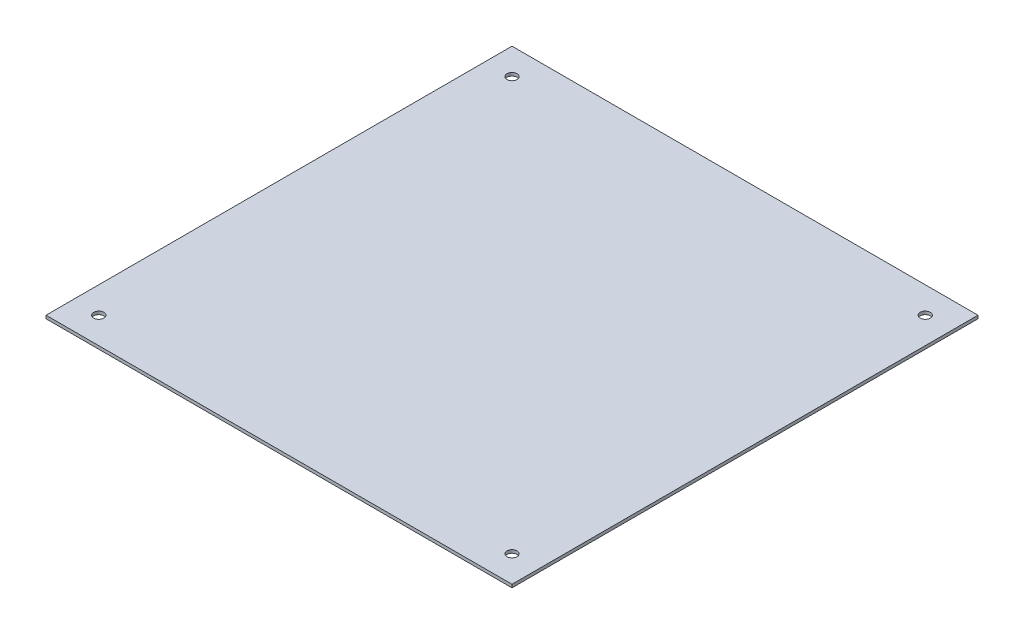
ISO-10303-21;
HEADER;
FILE_DESCRIPTION(('STEP AP214'),'2;1');
FILE_NAME('part.step','',(''),(''),'','','');
FILE_SCHEMA(('AUTOMOTIVE_DESIGN { 1 0 10303 214 1 1 1 1 }'));
ENDSEC;
DATA;
#1=APPLICATION_CONTEXT('core data for automotive mechanical design processes');
#2=APPLICATION_PROTOCOL_DEFINITION('international standard','automotive_design',2000,#1);
#3=PRODUCT_CONTEXT('',#1,'mechanical');
#4=PRODUCT('Part','Part','',(#3));
#5=PRODUCT_RELATED_PRODUCT_CATEGORY('part','',(#4));
#6=PRODUCT_DEFINITION_FORMATION('','',#4);
#7=PRODUCT_DEFINITION_CONTEXT('part definition',#1,'design');
#8=PRODUCT_DEFINITION('design','',#6,#7);
#9=PRODUCT_DEFINITION_SHAPE('','',#8);
#10=(LENGTH_UNIT() NAMED_UNIT(*) SI_UNIT(.MILLI.,.METRE.));
#11=(NAMED_UNIT(*) PLANE_ANGLE_UNIT() SI_UNIT($,.RADIAN.));
#12=(NAMED_UNIT(*) SI_UNIT($,.STERADIAN.) SOLID_ANGLE_UNIT());
#13=UNCERTAINTY_MEASURE_WITH_UNIT(LENGTH_MEASURE(1.E-05),#10,'distance_accuracy_value','');
#14=(GEOMETRIC_REPRESENTATION_CONTEXT(3) GLOBAL_UNCERTAINTY_ASSIGNED_CONTEXT((#13)) GLOBAL_UNIT_ASSIGNED_CONTEXT((#10,
#11,#12)) REPRESENTATION_CONTEXT('',''));
#15=CARTESIAN_POINT('',(0.,0.,0.));
#16=DIRECTION('',(0.,0.,1.));
#17=DIRECTION('',(1.,0.,0.));
#18=AXIS2_PLACEMENT_3D('',#15,#16,#17);
#19=CARTESIAN_POINT('',(150.,-2.,150.));
#20=DIRECTION('',(1.,0.,0.));
#21=DIRECTION('',(0.,0.,-1.));
#22=AXIS2_PLACEMENT_3D('',#19,#20,#21);
#23=PLANE('',#22);
#24=DIRECTION('',(0.,0.,-1.));
#25=VECTOR('',#24,1.);
#26=CARTESIAN_POINT('',(150.,0.,150.));
#27=LINE('',#26,#25);
#28=CARTESIAN_POINT('',(150.,0.,150.));
#29=VERTEX_POINT('',#28);
#30=CARTESIAN_POINT('',(150.,0.,-150.));
#31=VERTEX_POINT('',#30);
#32=EDGE_CURVE('E103',#29,#31,#27,.T.);
#33=ORIENTED_EDGE('',*,*,#32,.F.);
#34=DIRECTION('',(0.,1.,0.));
#35=VECTOR('',#34,1.);
#36=CARTESIAN_POINT('',(150.,-2.,150.));
#37=LINE('',#36,#35);
#38=CARTESIAN_POINT('',(150.,-2.,150.));
#39=VERTEX_POINT('',#38);
#40=EDGE_CURVE('E11',#39,#29,#37,.T.);
#41=ORIENTED_EDGE('',*,*,#40,.F.);
#42=DIRECTION('',(0.,0.,-1.));
#43=VECTOR('',#42,1.);
#44=CARTESIAN_POINT('',(150.,-2.,150.));
#45=LINE('',#44,#43);
#46=CARTESIAN_POINT('',(150.,-2.,-150.));
#47=VERTEX_POINT('',#46);
#48=EDGE_CURVE('E96',#39,#47,#45,.T.);
#49=ORIENTED_EDGE('',*,*,#48,.T.);
#50=DIRECTION('',(0.,1.,0.));
#51=VECTOR('',#50,1.);
#52=CARTESIAN_POINT('',(150.,-2.,-150.));
#53=LINE('',#52,#51);
#54=EDGE_CURVE('E41',#47,#31,#53,.T.);
#55=ORIENTED_EDGE('',*,*,#54,.T.);
#56=EDGE_LOOP('',(#33,#41,#49,#55));
#57=FACE_BOUND('',#56,.T.);
#58=ADVANCED_FACE('F38',(#57),#23,.T.);
#59=CARTESIAN_POINT('',(-150.,-2.,150.));
#60=DIRECTION('',(0.,0.,1.));
#61=DIRECTION('',(1.,0.,0.));
#62=AXIS2_PLACEMENT_3D('',#59,#60,#61);
#63=PLANE('',#62);
#64=DIRECTION('',(1.,0.,0.));
#65=VECTOR('',#64,1.);
#66=CARTESIAN_POINT('',(-150.,0.,150.));
#67=LINE('',#66,#65);
#68=CARTESIAN_POINT('',(-150.,0.,150.));
#69=VERTEX_POINT('',#68);
#70=EDGE_CURVE('E98',#69,#29,#67,.T.);
#71=ORIENTED_EDGE('',*,*,#70,.F.);
#72=DIRECTION('',(0.,1.,0.));
#73=VECTOR('',#72,1.);
#74=CARTESIAN_POINT('',(-150.,-2.,150.));
#75=LINE('',#74,#73);
#76=CARTESIAN_POINT('',(-150.,-2.,150.));
#77=VERTEX_POINT('',#76);
#78=EDGE_CURVE('E47',#77,#69,#75,.T.);
#79=ORIENTED_EDGE('',*,*,#78,.F.);
#80=DIRECTION('',(1.,0.,0.));
#81=VECTOR('',#80,1.);
#82=CARTESIAN_POINT('',(-150.,-2.,150.));
#83=LINE('',#82,#81);
#84=EDGE_CURVE('E93',#77,#39,#83,.T.);
#85=ORIENTED_EDGE('',*,*,#84,.T.);
#86=ORIENTED_EDGE('',*,*,#40,.T.);
#87=EDGE_LOOP('',(#71,#79,#85,#86));
#88=FACE_BOUND('',#87,.T.);
#89=ADVANCED_FACE('F114',(#88),#63,.T.);
#90=CARTESIAN_POINT('',(-150.,-2.,150.));
#91=DIRECTION('',(-1.,0.,0.));
#92=DIRECTION('',(0.,0.,1.));
#93=AXIS2_PLACEMENT_3D('',#90,#91,#92);
#94=PLANE('',#93);
#95=DIRECTION('',(0.,0.,1.));
#96=VECTOR('',#95,1.);
#97=CARTESIAN_POINT('',(-150.,0.,150.));
#98=LINE('',#97,#96);
#99=CARTESIAN_POINT('',(-150.,0.,-150.));
#100=VERTEX_POINT('',#99);
#101=EDGE_CURVE('E88',#100,#69,#98,.T.);
#102=ORIENTED_EDGE('',*,*,#101,.F.);
#103=DIRECTION('',(0.,1.,0.));
#104=VECTOR('',#103,1.);
#105=CARTESIAN_POINT('',(-150.,-2.,-150.));
#106=LINE('',#105,#104);
#107=CARTESIAN_POINT('',(-150.,-2.,-150.));
#108=VERTEX_POINT('',#107);
#109=EDGE_CURVE('E83',#108,#100,#106,.T.);
#110=ORIENTED_EDGE('',*,*,#109,.F.);
#111=DIRECTION('',(0.,0.,1.));
#112=VECTOR('',#111,1.);
#113=CARTESIAN_POINT('',(-150.,-2.,150.));
#114=LINE('',#113,#112);
#115=EDGE_CURVE('E86',#108,#77,#114,.T.);
#116=ORIENTED_EDGE('',*,*,#115,.T.);
#117=ORIENTED_EDGE('',*,*,#78,.T.);
#118=EDGE_LOOP('',(#102,#110,#116,#117));
#119=FACE_BOUND('',#118,.T.);
#120=ADVANCED_FACE('F85',(#119),#94,.T.);
#121=CARTESIAN_POINT('',(-150.,-2.,-150.));
#122=DIRECTION('',(0.,0.,-1.));
#123=DIRECTION('',(-1.,0.,0.));
#124=AXIS2_PLACEMENT_3D('',#121,#122,#123);
#125=PLANE('',#124);
#126=DIRECTION('',(-1.,0.,0.));
#127=VECTOR('',#126,1.);
#128=CARTESIAN_POINT('',(-150.,0.,-150.));
#129=LINE('',#128,#127);
#130=EDGE_CURVE('E106',#31,#100,#129,.T.);
#131=ORIENTED_EDGE('',*,*,#130,.F.);
#132=ORIENTED_EDGE('',*,*,#54,.F.);
#133=DIRECTION('',(-1.,0.,0.));
#134=VECTOR('',#133,1.);
#135=CARTESIAN_POINT('',(-150.,-2.,-150.));
#136=LINE('',#135,#134);
#137=EDGE_CURVE('E92',#47,#108,#136,.T.);
#138=ORIENTED_EDGE('',*,*,#137,.T.);
#139=ORIENTED_EDGE('',*,*,#109,.T.);
#140=EDGE_LOOP('',(#131,#132,#138,#139));
#141=FACE_BOUND('',#140,.T.);
#142=ADVANCED_FACE('F95',(#141),#125,.T.);
#143=CARTESIAN_POINT('',(0.,-2.,0.));
#144=DIRECTION('',(0.,-1.,0.));
#145=DIRECTION('',(0.,0.,-1.));
#146=AXIS2_PLACEMENT_3D('',#143,#144,#145);
#147=PLANE('',#146);
#148=CARTESIAN_POINT('',(-133.,-2.,-133.));
#149=DIRECTION('',(0.,-1.,0.));
#150=DIRECTION('',(0.,0.,-1.));
#151=AXIS2_PLACEMENT_3D('',#148,#149,#150);
#152=CIRCLE('',#151,3.24999999999999);
#153=CARTESIAN_POINT('',(-133.,-2.,-136.25));
#154=VERTEX_POINT('',#153);
#155=EDGE_CURVE('E158',#154,#154,#152,.T.);
#156=ORIENTED_EDGE('',*,*,#155,.F.);
#157=EDGE_LOOP('',(#156));
#158=FACE_BOUND('',#157,.T.);
#159=CARTESIAN_POINT('',(132.999999999997,-2.,-133.));
#160=DIRECTION('',(0.,-1.,0.));
#161=DIRECTION('',(0.,0.,-1.));
#162=AXIS2_PLACEMENT_3D('',#159,#160,#161);
#163=CIRCLE('',#162,3.24999999999999);
#164=CARTESIAN_POINT('',(132.999999999997,-2.,-136.25));
#165=VERTEX_POINT('',#164);
#166=EDGE_CURVE('E162',#165,#165,#163,.T.);
#167=ORIENTED_EDGE('',*,*,#166,.F.);
#168=EDGE_LOOP('',(#167));
#169=FACE_BOUND('',#168,.T.);
#170=CARTESIAN_POINT('',(133.,-2.,133.));
#171=DIRECTION('',(0.,-1.,0.));
#172=DIRECTION('',(0.,0.,-1.));
#173=AXIS2_PLACEMENT_3D('',#170,#171,#172);
#174=CIRCLE('',#173,3.24999999999999);
#175=CARTESIAN_POINT('',(133.,-2.,129.75));
#176=VERTEX_POINT('',#175);
#177=EDGE_CURVE('E171',#176,#176,#174,.T.);
#178=ORIENTED_EDGE('',*,*,#177,.F.);
#179=EDGE_LOOP('',(#178));
#180=FACE_BOUND('',#179,.T.);
#181=CARTESIAN_POINT('',(-132.999999999997,-2.,133.));
#182=DIRECTION('',(0.,-1.,0.));
#183=DIRECTION('',(0.,0.,-1.));
#184=AXIS2_PLACEMENT_3D('',#181,#182,#183);
#185=CIRCLE('',#184,3.24999999999999);
#186=CARTESIAN_POINT('',(-132.999999999997,-2.,129.75));
#187=VERTEX_POINT('',#186);
#188=EDGE_CURVE('E107',#187,#187,#185,.T.);
#189=ORIENTED_EDGE('',*,*,#188,.F.);
#190=EDGE_LOOP('',(#189));
#191=FACE_BOUND('',#190,.T.);
#192=ORIENTED_EDGE('',*,*,#48,.F.);
#193=ORIENTED_EDGE('',*,*,#84,.F.);
#194=ORIENTED_EDGE('',*,*,#115,.F.);
#195=ORIENTED_EDGE('',*,*,#137,.F.);
#196=EDGE_LOOP('',(#192,#193,#194,#195));
#197=FACE_BOUND('',#196,.T.);
#198=ADVANCED_FACE('F91',(#158,#169,#180,#191,#197),#147,.T.);
#199=CARTESIAN_POINT('',(0.,0.,0.));
#200=DIRECTION('',(0.,-1.,0.));
#201=DIRECTION('',(0.,0.,-1.));
#202=AXIS2_PLACEMENT_3D('',#199,#200,#201);
#203=PLANE('',#202);
#204=CARTESIAN_POINT('',(-133.,0.,-133.));
#205=DIRECTION('',(0.,1.,0.));
#206=DIRECTION('',(0.,0.,1.));
#207=AXIS2_PLACEMENT_3D('',#204,#205,#206);
#208=CIRCLE('',#207,3.24999999999998);
#209=CARTESIAN_POINT('',(-133.,0.,-129.75));
#210=VERTEX_POINT('',#209);
#211=EDGE_CURVE('E156',#210,#210,#208,.T.);
#212=ORIENTED_EDGE('',*,*,#211,.F.);
#213=EDGE_LOOP('',(#212));
#214=FACE_BOUND('',#213,.T.);
#215=CARTESIAN_POINT('',(132.999999999997,0.,-133.));
#216=DIRECTION('',(0.,1.,0.));
#217=DIRECTION('',(0.,0.,1.));
#218=AXIS2_PLACEMENT_3D('',#215,#216,#217);
#219=CIRCLE('',#218,3.24999999999998);
#220=CARTESIAN_POINT('',(132.999999999997,0.,-129.75));
#221=VERTEX_POINT('',#220);
#222=EDGE_CURVE('E159',#221,#221,#219,.T.);
#223=ORIENTED_EDGE('',*,*,#222,.F.);
#224=EDGE_LOOP('',(#223));
#225=FACE_BOUND('',#224,.T.);
#226=CARTESIAN_POINT('',(133.,0.,133.));
#227=DIRECTION('',(0.,1.,0.));
#228=DIRECTION('',(0.,0.,1.));
#229=AXIS2_PLACEMENT_3D('',#226,#227,#228);
#230=CIRCLE('',#229,3.24999999999998);
#231=CARTESIAN_POINT('',(133.,0.,136.25));
#232=VERTEX_POINT('',#231);
#233=EDGE_CURVE('E168',#232,#232,#230,.T.);
#234=ORIENTED_EDGE('',*,*,#233,.F.);
#235=EDGE_LOOP('',(#234));
#236=FACE_BOUND('',#235,.T.);
#237=CARTESIAN_POINT('',(-132.999999999997,0.,133.));
#238=DIRECTION('',(0.,1.,0.));
#239=DIRECTION('',(0.,0.,1.));
#240=AXIS2_PLACEMENT_3D('',#237,#238,#239);
#241=CIRCLE('',#240,3.24999999999998);
#242=CARTESIAN_POINT('',(-132.999999999997,0.,136.25));
#243=VERTEX_POINT('',#242);
#244=EDGE_CURVE('E174',#243,#243,#241,.T.);
#245=ORIENTED_EDGE('',*,*,#244,.F.);
#246=EDGE_LOOP('',(#245));
#247=FACE_BOUND('',#246,.T.);
#248=ORIENTED_EDGE('',*,*,#32,.T.);
#249=ORIENTED_EDGE('',*,*,#130,.T.);
#250=ORIENTED_EDGE('',*,*,#101,.T.);
#251=ORIENTED_EDGE('',*,*,#70,.T.);
#252=EDGE_LOOP('',(#248,#249,#250,#251));
#253=FACE_BOUND('',#252,.T.);
#254=ADVANCED_FACE('F113',(#214,#225,#236,#247,#253),#203,.F.);
#255=CARTESIAN_POINT('',(-132.999999999997,0.,133.));
#256=DIRECTION('',(0.,1.,0.));
#257=DIRECTION('',(0.,0.,1.));
#258=AXIS2_PLACEMENT_3D('',#255,#256,#257);
#259=CYLINDRICAL_SURFACE('',#258,3.24999999999999);
#260=ORIENTED_EDGE('',*,*,#244,.T.);
#261=EDGE_LOOP('',(#260));
#262=FACE_BOUND('',#261,.T.);
#263=ORIENTED_EDGE('',*,*,#188,.T.);
#264=EDGE_LOOP('',(#263));
#265=FACE_BOUND('',#264,.T.);
#266=ADVANCED_FACE('F132',(#262,#265),#259,.F.);
#267=CARTESIAN_POINT('',(133.,0.,133.));
#268=DIRECTION('',(0.,1.,0.));
#269=DIRECTION('',(0.,0.,1.));
#270=AXIS2_PLACEMENT_3D('',#267,#268,#269);
#271=CYLINDRICAL_SURFACE('',#270,3.24999999999999);
#272=ORIENTED_EDGE('',*,*,#233,.T.);
#273=EDGE_LOOP('',(#272));
#274=FACE_BOUND('',#273,.T.);
#275=ORIENTED_EDGE('',*,*,#177,.T.);
#276=EDGE_LOOP('',(#275));
#277=FACE_BOUND('',#276,.T.);
#278=ADVANCED_FACE('F139',(#274,#277),#271,.F.);
#279=CARTESIAN_POINT('',(132.999999999997,0.,-133.));
#280=DIRECTION('',(0.,1.,0.));
#281=DIRECTION('',(0.,0.,1.));
#282=AXIS2_PLACEMENT_3D('',#279,#280,#281);
#283=CYLINDRICAL_SURFACE('',#282,3.24999999999999);
#284=ORIENTED_EDGE('',*,*,#222,.T.);
#285=EDGE_LOOP('',(#284));
#286=FACE_BOUND('',#285,.T.);
#287=ORIENTED_EDGE('',*,*,#166,.T.);
#288=EDGE_LOOP('',(#287));
#289=FACE_BOUND('',#288,.T.);
#290=ADVANCED_FACE('F143',(#286,#289),#283,.F.);
#291=CARTESIAN_POINT('',(-133.,0.,-133.));
#292=DIRECTION('',(0.,1.,0.));
#293=DIRECTION('',(0.,0.,1.));
#294=AXIS2_PLACEMENT_3D('',#291,#292,#293);
#295=CYLINDRICAL_SURFACE('',#294,3.24999999999999);
#296=ORIENTED_EDGE('',*,*,#211,.T.);
#297=EDGE_LOOP('',(#296));
#298=FACE_BOUND('',#297,.T.);
#299=ORIENTED_EDGE('',*,*,#155,.T.);
#300=EDGE_LOOP('',(#299));
#301=FACE_BOUND('',#300,.T.);
#302=ADVANCED_FACE('F147',(#298,#301),#295,.F.);
#303=CLOSED_SHELL('',(#58,#89,#120,#142,#198,#254,#266,#278,#290,#302));
#304=MANIFOLD_SOLID_BREP('B2',#303);
#305=ADVANCED_BREP_SHAPE_REPRESENTATION('',(#18,#304),#14);
#306=SHAPE_DEFINITION_REPRESENTATION(#9,#305);
ENDSEC;
END-ISO-10303-21;
